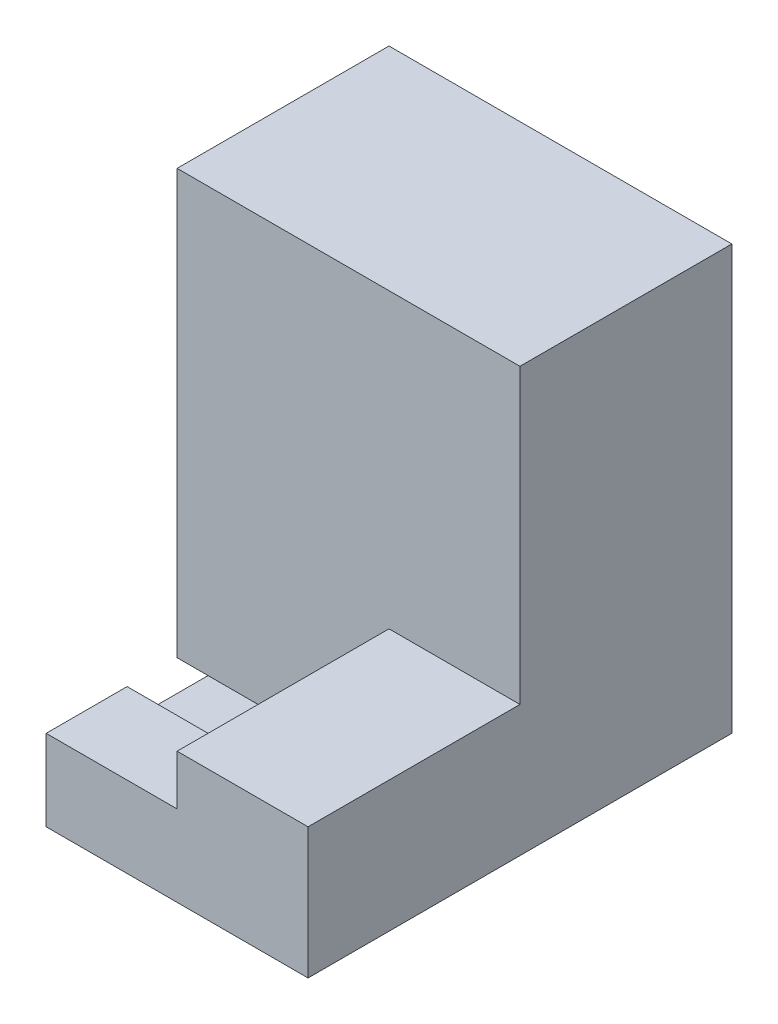
ISO-10303-21;
HEADER;
FILE_DESCRIPTION(('STEP AP214'),'2;1');
FILE_NAME('part.step','',(''),(''),'','','');
FILE_SCHEMA(('AUTOMOTIVE_DESIGN { 1 0 10303 214 1 1 1 1 }'));
ENDSEC;
DATA;
#1=APPLICATION_CONTEXT('core data for automotive mechanical design processes');
#2=APPLICATION_PROTOCOL_DEFINITION('international standard','automotive_design',2000,#1);
#3=PRODUCT_CONTEXT('',#1,'mechanical');
#4=PRODUCT('Part','Part','',(#3));
#5=PRODUCT_RELATED_PRODUCT_CATEGORY('part','',(#4));
#6=PRODUCT_DEFINITION_FORMATION('','',#4);
#7=PRODUCT_DEFINITION_CONTEXT('part definition',#1,'design');
#8=PRODUCT_DEFINITION('design','',#6,#7);
#9=PRODUCT_DEFINITION_SHAPE('','',#8);
#10=(LENGTH_UNIT() NAMED_UNIT(*) SI_UNIT(.MILLI.,.METRE.));
#11=(NAMED_UNIT(*) PLANE_ANGLE_UNIT() SI_UNIT($,.RADIAN.));
#12=(NAMED_UNIT(*) SI_UNIT($,.STERADIAN.) SOLID_ANGLE_UNIT());
#13=UNCERTAINTY_MEASURE_WITH_UNIT(LENGTH_MEASURE(1.E-05),#10,'distance_accuracy_value','');
#14=(GEOMETRIC_REPRESENTATION_CONTEXT(3) GLOBAL_UNCERTAINTY_ASSIGNED_CONTEXT((#13)) GLOBAL_UNIT_ASSIGNED_CONTEXT((#10,
#11,#12)) REPRESENTATION_CONTEXT('',''));
#15=CARTESIAN_POINT('',(0.,0.,0.));
#16=DIRECTION('',(0.,0.,1.));
#17=DIRECTION('',(1.,0.,0.));
#18=AXIS2_PLACEMENT_3D('',#15,#16,#17);
#19=CARTESIAN_POINT('',(2.00128494099436,1.,0.));
#20=DIRECTION('',(1.,0.,0.));
#21=DIRECTION('',(0.,0.,-1.));
#22=AXIS2_PLACEMENT_3D('',#19,#20,#21);
#23=PLANE('',#22);
#24=DIRECTION('',(0.,0.,1.));
#25=VECTOR('',#24,1.);
#26=CARTESIAN_POINT('',(2.00128494099436,0.,0.));
#27=LINE('',#26,#25);
#28=CARTESIAN_POINT('',(2.00128494099436,0.,-2.9976998143222));
#29=VERTEX_POINT('',#28);
#30=CARTESIAN_POINT('',(2.00128494099436,0.,0.99719090253839));
#31=VERTEX_POINT('',#30);
#32=EDGE_CURVE('E131',#29,#31,#27,.T.);
#33=ORIENTED_EDGE('',*,*,#32,.F.);
#34=DIRECTION('',(0.,-1.,0.));
#35=VECTOR('',#34,1.);
#36=CARTESIAN_POINT('',(2.00128494099436,2.,-2.9976998143222));
#37=LINE('',#36,#35);
#38=CARTESIAN_POINT('',(2.00128494099436,2.,-2.9976998143222));
#39=VERTEX_POINT('',#38);
#40=EDGE_CURVE('E181',#39,#29,#37,.T.);
#41=ORIENTED_EDGE('',*,*,#40,.F.);
#42=DIRECTION('',(0.,0.,-1.));
#43=VECTOR('',#42,1.);
#44=CARTESIAN_POINT('',(2.00128494099436,2.,0.));
#45=LINE('',#44,#43);
#46=CARTESIAN_POINT('',(2.00128494099436,2.,-1.));
#47=VERTEX_POINT('',#46);
#48=EDGE_CURVE('E198',#47,#39,#45,.T.);
#49=ORIENTED_EDGE('',*,*,#48,.F.);
#50=DIRECTION('',(0.,-1.,0.));
#51=VECTOR('',#50,1.);
#52=CARTESIAN_POINT('',(2.00128494099436,2.,-1.));
#53=LINE('',#52,#51);
#54=CARTESIAN_POINT('',(2.00128494099436,1.,-1.));
#55=VERTEX_POINT('',#54);
#56=EDGE_CURVE('E166',#47,#55,#53,.T.);
#57=ORIENTED_EDGE('',*,*,#56,.T.);
#58=DIRECTION('',(0.,0.,1.));
#59=VECTOR('',#58,1.);
#60=CARTESIAN_POINT('',(2.00128494099436,1.,0.));
#61=LINE('',#60,#59);
#62=CARTESIAN_POINT('',(2.00128494099436,1.,0.99719090253839));
#63=VERTEX_POINT('',#62);
#64=EDGE_CURVE('E108',#55,#63,#61,.T.);
#65=ORIENTED_EDGE('',*,*,#64,.T.);
#66=DIRECTION('',(0.,-1.,0.));
#67=VECTOR('',#66,1.);
#68=CARTESIAN_POINT('',(2.00128494099436,1.,0.99719090253839));
#69=LINE('',#68,#67);
#70=EDGE_CURVE('E126',#63,#31,#69,.T.);
#71=ORIENTED_EDGE('',*,*,#70,.T.);
#72=EDGE_LOOP('',(#33,#41,#49,#57,#65,#71));
#73=FACE_BOUND('',#72,.T.);
#74=ADVANCED_FACE('F65',(#73),#23,.T.);
#75=CARTESIAN_POINT('',(1.,1.,0.));
#76=DIRECTION('',(-1.,0.,0.));
#77=DIRECTION('',(0.,0.,1.));
#78=AXIS2_PLACEMENT_3D('',#75,#76,#77);
#79=PLANE('',#78);
#80=DIRECTION('',(0.,-1.,0.));
#81=VECTOR('',#80,1.);
#82=CARTESIAN_POINT('',(1.,1.,0.));
#83=LINE('',#82,#81);
#84=CARTESIAN_POINT('',(1.,1.,0.));
#85=VERTEX_POINT('',#84);
#86=CARTESIAN_POINT('',(1.,0.,0.));
#87=VERTEX_POINT('',#86);
#88=EDGE_CURVE('E12',#85,#87,#83,.T.);
#89=ORIENTED_EDGE('',*,*,#88,.F.);
#90=DIRECTION('',(0.,0.,-1.));
#91=VECTOR('',#90,1.);
#92=CARTESIAN_POINT('',(1.,1.,0.));
#93=LINE('',#92,#91);
#94=CARTESIAN_POINT('',(1.,1.,-1.));
#95=VERTEX_POINT('',#94);
#96=EDGE_CURVE('E173',#85,#95,#93,.T.);
#97=ORIENTED_EDGE('',*,*,#96,.T.);
#98=DIRECTION('',(0.,-1.,0.));
#99=VECTOR('',#98,1.);
#100=CARTESIAN_POINT('',(1.,1.,-1.));
#101=LINE('',#100,#99);
#102=CARTESIAN_POINT('',(1.,0.,-1.));
#103=VERTEX_POINT('',#102);
#104=EDGE_CURVE('E74',#95,#103,#101,.T.);
#105=ORIENTED_EDGE('',*,*,#104,.T.);
#106=DIRECTION('',(0.,0.,-1.));
#107=VECTOR('',#106,1.);
#108=CARTESIAN_POINT('',(1.,0.,0.));
#109=LINE('',#108,#107);
#110=EDGE_CURVE('E143',#87,#103,#109,.T.);
#111=ORIENTED_EDGE('',*,*,#110,.F.);
#112=EDGE_LOOP('',(#89,#97,#105,#111));
#113=FACE_BOUND('',#112,.T.);
#114=ADVANCED_FACE('F631',(#113),#79,.T.);
#115=CARTESIAN_POINT('',(0.,1.,0.99719090253839));
#116=DIRECTION('',(0.,0.,-1.));
#117=DIRECTION('',(-1.,0.,0.));
#118=AXIS2_PLACEMENT_3D('',#115,#116,#117);
#119=PLANE('',#118);
#120=DIRECTION('',(1.,0.,0.));
#121=VECTOR('',#120,1.);
#122=CARTESIAN_POINT('',(0.,0.,0.99719090253839));
#123=LINE('',#122,#121);
#124=CARTESIAN_POINT('',(0.,0.,0.99719090253839));
#125=VERTEX_POINT('',#124);
#126=EDGE_CURVE('E138',#125,#31,#123,.T.);
#127=ORIENTED_EDGE('',*,*,#126,.T.);
#128=ORIENTED_EDGE('',*,*,#70,.F.);
#129=DIRECTION('',(1.,0.,0.));
#130=VECTOR('',#129,1.);
#131=CARTESIAN_POINT('',(0.,1.,0.99719090253839));
#132=LINE('',#131,#130);
#133=CARTESIAN_POINT('',(0.,1.,0.99719090253839));
#134=VERTEX_POINT('',#133);
#135=EDGE_CURVE('E135',#134,#63,#132,.T.);
#136=ORIENTED_EDGE('',*,*,#135,.F.);
#137=DIRECTION('',(0.,-1.,0.));
#138=VECTOR('',#137,1.);
#139=CARTESIAN_POINT('',(0.,1.,0.99719090253839));
#140=LINE('',#139,#138);
#141=EDGE_CURVE('E141',#134,#125,#140,.T.);
#142=ORIENTED_EDGE('',*,*,#141,.T.);
#143=EDGE_LOOP('',(#127,#128,#136,#142));
#144=FACE_BOUND('',#143,.T.);
#145=ADVANCED_FACE('F139',(#144),#119,.F.);
#146=CARTESIAN_POINT('',(0.,1.,0.));
#147=DIRECTION('',(0.,1.,0.));
#148=DIRECTION('',(0.,0.,1.));
#149=AXIS2_PLACEMENT_3D('',#146,#147,#148);
#150=PLANE('',#149);
#151=ORIENTED_EDGE('',*,*,#64,.F.);
#152=DIRECTION('',(1.,0.,0.));
#153=VECTOR('',#152,1.);
#154=CARTESIAN_POINT('',(0.,1.,-1.));
#155=LINE('',#154,#153);
#156=EDGE_CURVE('E175',#95,#55,#155,.T.);
#157=ORIENTED_EDGE('',*,*,#156,.F.);
#158=ORIENTED_EDGE('',*,*,#96,.F.);
#159=DIRECTION('',(1.,0.,0.));
#160=VECTOR('',#159,1.);
#161=CARTESIAN_POINT('',(0.,1.,0.));
#162=LINE('',#161,#160);
#163=CARTESIAN_POINT('',(0.,1.,0.));
#164=VERTEX_POINT('',#163);
#165=EDGE_CURVE('E157',#164,#85,#162,.T.);
#166=ORIENTED_EDGE('',*,*,#165,.F.);
#167=DIRECTION('',(0.,0.,1.));
#168=VECTOR('',#167,1.);
#169=CARTESIAN_POINT('',(0.,1.,0.));
#170=LINE('',#169,#168);
#171=EDGE_CURVE('E159',#164,#134,#170,.T.);
#172=ORIENTED_EDGE('',*,*,#171,.T.);
#173=ORIENTED_EDGE('',*,*,#135,.T.);
#174=EDGE_LOOP('',(#151,#157,#158,#166,#172,#173));
#175=FACE_BOUND('',#174,.T.);
#176=ADVANCED_FACE('F174',(#175),#150,.T.);
#177=CARTESIAN_POINT('',(0.,0.,0.));
#178=DIRECTION('',(0.,1.,0.));
#179=DIRECTION('',(0.,0.,1.));
#180=AXIS2_PLACEMENT_3D('',#177,#178,#179);
#181=PLANE('',#180);
#182=ORIENTED_EDGE('',*,*,#32,.T.);
#183=ORIENTED_EDGE('',*,*,#126,.F.);
#184=DIRECTION('',(0.,0.,1.));
#185=VECTOR('',#184,1.);
#186=CARTESIAN_POINT('',(0.,0.,0.));
#187=LINE('',#186,#185);
#188=CARTESIAN_POINT('',(0.,0.,0.));
#189=VERTEX_POINT('',#188);
#190=EDGE_CURVE('E160',#189,#125,#187,.T.);
#191=ORIENTED_EDGE('',*,*,#190,.F.);
#192=DIRECTION('',(1.,0.,0.));
#193=VECTOR('',#192,1.);
#194=CARTESIAN_POINT('',(0.,0.,0.));
#195=LINE('',#194,#193);
#196=EDGE_CURVE('E163',#189,#87,#195,.T.);
#197=ORIENTED_EDGE('',*,*,#196,.T.);
#198=ORIENTED_EDGE('',*,*,#110,.T.);
#199=DIRECTION('',(1.,0.,0.));
#200=VECTOR('',#199,1.);
#201=CARTESIAN_POINT('',(0.,0.,-1.));
#202=LINE('',#201,#200);
#203=CARTESIAN_POINT('',(-1.,0.,-1.));
#204=VERTEX_POINT('',#203);
#205=EDGE_CURVE('E189',#204,#103,#202,.T.);
#206=ORIENTED_EDGE('',*,*,#205,.F.);
#207=DIRECTION('',(0.,0.,1.));
#208=VECTOR('',#207,1.);
#209=CARTESIAN_POINT('',(-1.,0.,0.));
#210=LINE('',#209,#208);
#211=CARTESIAN_POINT('',(-1.,0.,2.));
#212=VERTEX_POINT('',#211);
#213=EDGE_CURVE('E212',#204,#212,#210,.T.);
#214=ORIENTED_EDGE('',*,*,#213,.T.);
#215=DIRECTION('',(1.,0.,0.));
#216=VECTOR('',#215,1.);
#217=CARTESIAN_POINT('',(0.,0.,2.));
#218=LINE('',#217,#216);
#219=CARTESIAN_POINT('',(4.,0.,2.));
#220=VERTEX_POINT('',#219);
#221=EDGE_CURVE('E243',#212,#220,#218,.T.);
#222=ORIENTED_EDGE('',*,*,#221,.T.);
#223=DIRECTION('',(0.,0.,-1.));
#224=VECTOR('',#223,1.);
#225=CARTESIAN_POINT('',(4.,0.,0.));
#226=LINE('',#225,#224);
#227=CARTESIAN_POINT('',(4.,0.,-6.));
#228=VERTEX_POINT('',#227);
#229=EDGE_CURVE('E266',#220,#228,#226,.T.);
#230=ORIENTED_EDGE('',*,*,#229,.T.);
#231=DIRECTION('',(-1.,0.,0.));
#232=VECTOR('',#231,1.);
#233=CARTESIAN_POINT('',(0.,0.,-6.));
#234=LINE('',#233,#232);
#235=CARTESIAN_POINT('',(-9.,0.,-6.));
#236=VERTEX_POINT('',#235);
#237=EDGE_CURVE('E297',#228,#236,#234,.T.);
#238=ORIENTED_EDGE('',*,*,#237,.T.);
#239=DIRECTION('',(0.,0.,1.));
#240=VECTOR('',#239,1.);
#241=CARTESIAN_POINT('',(-9.,0.,0.));
#242=LINE('',#241,#240);
#243=CARTESIAN_POINT('',(-9.,0.,15.));
#244=VERTEX_POINT('',#243);
#245=EDGE_CURVE('E320',#236,#244,#242,.T.);
#246=ORIENTED_EDGE('',*,*,#245,.T.);
#247=DIRECTION('',(1.,0.,0.));
#248=VECTOR('',#247,1.);
#249=CARTESIAN_POINT('',(0.,0.,15.));
#250=LINE('',#249,#248);
#251=CARTESIAN_POINT('',(25.,0.,15.));
#252=VERTEX_POINT('',#251);
#253=EDGE_CURVE('E351',#244,#252,#250,.T.);
#254=ORIENTED_EDGE('',*,*,#253,.T.);
#255=DIRECTION('',(0.,0.,-1.));
#256=VECTOR('',#255,1.);
#257=CARTESIAN_POINT('',(25.,0.,0.));
#258=LINE('',#257,#256);
#259=CARTESIAN_POINT('',(25.,0.,-40.));
#260=VERTEX_POINT('',#259);
#261=EDGE_CURVE('E374',#252,#260,#258,.T.);
#262=ORIENTED_EDGE('',*,*,#261,.T.);
#263=DIRECTION('',(-1.,0.,0.));
#264=VECTOR('',#263,1.);
#265=CARTESIAN_POINT('',(0.,0.,-40.));
#266=LINE('',#265,#264);
#267=CARTESIAN_POINT('',(-64.,0.,-40.));
#268=VERTEX_POINT('',#267);
#269=EDGE_CURVE('E408',#260,#268,#266,.T.);
#270=ORIENTED_EDGE('',*,*,#269,.T.);
#271=DIRECTION('',(0.,0.,-1.));
#272=VECTOR('',#271,1.);
#273=CARTESIAN_POINT('',(-64.,0.,0.));
#274=LINE('',#273,#272);
#275=CARTESIAN_POINT('',(-64.,0.,-128.996056825207));
#276=VERTEX_POINT('',#275);
#277=EDGE_CURVE('E411',#268,#276,#274,.T.);
#278=ORIENTED_EDGE('',*,*,#277,.T.);
#279=DIRECTION('',(-1.,0.,0.));
#280=VECTOR('',#279,1.);
#281=CARTESIAN_POINT('',(0.,0.,-128.996056825207));
#282=LINE('',#281,#280);
#283=CARTESIAN_POINT('',(79.9988032331522,0.,-128.996056825207));
#284=VERTEX_POINT('',#283);
#285=EDGE_CURVE('E404',#284,#276,#282,.T.);
#286=ORIENTED_EDGE('',*,*,#285,.F.);
#287=DIRECTION('',(0.,0.,-1.));
#288=VECTOR('',#287,1.);
#289=CARTESIAN_POINT('',(79.9988032331522,0.,0.));
#290=LINE('',#289,#288);
#291=CARTESIAN_POINT('',(79.9988032331522,0.,49.0049162017066));
#292=VERTEX_POINT('',#291);
#293=EDGE_CURVE('E378',#292,#284,#290,.T.);
#294=ORIENTED_EDGE('',*,*,#293,.F.);
#295=DIRECTION('',(1.,0.,0.));
#296=VECTOR('',#295,1.);
#297=CARTESIAN_POINT('',(0.,0.,49.0049162017066));
#298=LINE('',#297,#296);
#299=CARTESIAN_POINT('',(-30.0000636841698,0.,49.0049162017066));
#300=VERTEX_POINT('',#299);
#301=EDGE_CURVE('E347',#300,#292,#298,.T.);
#302=ORIENTED_EDGE('',*,*,#301,.F.);
#303=DIRECTION('',(0.,0.,1.));
#304=VECTOR('',#303,1.);
#305=CARTESIAN_POINT('',(-30.0000636841698,0.,0.));
#306=LINE('',#305,#304);
#307=CARTESIAN_POINT('',(-30.0000636841698,0.,-18.9955752427666));
#308=VERTEX_POINT('',#307);
#309=EDGE_CURVE('E324',#308,#300,#306,.T.);
#310=ORIENTED_EDGE('',*,*,#309,.F.);
#311=DIRECTION('',(-1.,0.,0.));
#312=VECTOR('',#311,1.);
#313=CARTESIAN_POINT('',(0.,0.,-18.9955752427666));
#314=LINE('',#313,#312);
#315=CARTESIAN_POINT('',(12.0032429256272,0.,-18.9955752427666));
#316=VERTEX_POINT('',#315);
#317=EDGE_CURVE('E293',#316,#308,#314,.T.);
#318=ORIENTED_EDGE('',*,*,#317,.F.);
#319=DIRECTION('',(0.,0.,-1.));
#320=VECTOR('',#319,1.);
#321=CARTESIAN_POINT('',(12.0032429256272,0.,0.));
#322=LINE('',#321,#320);
#323=CARTESIAN_POINT('',(12.0032429256272,0.,6.99693228758156));
#324=VERTEX_POINT('',#323);
#325=EDGE_CURVE('E270',#324,#316,#322,.T.);
#326=ORIENTED_EDGE('',*,*,#325,.F.);
#327=DIRECTION('',(1.,0.,0.));
#328=VECTOR('',#327,1.);
#329=CARTESIAN_POINT('',(0.,0.,6.99693228758156));
#330=LINE('',#329,#328);
#331=CARTESIAN_POINT('',(-3.99974109811252,0.,6.99693228758156));
#332=VERTEX_POINT('',#331);
#333=EDGE_CURVE('E239',#332,#324,#330,.T.);
#334=ORIENTED_EDGE('',*,*,#333,.F.);
#335=DIRECTION('',(0.,0.,1.));
#336=VECTOR('',#335,1.);
#337=CARTESIAN_POINT('',(-3.99974109811252,0.,0.));
#338=LINE('',#337,#336);
#339=CARTESIAN_POINT('',(-3.99974109811252,0.,-2.9976998143222));
#340=VERTEX_POINT('',#339);
#341=EDGE_CURVE('E216',#340,#332,#338,.T.);
#342=ORIENTED_EDGE('',*,*,#341,.F.);
#343=DIRECTION('',(1.,0.,0.));
#344=VECTOR('',#343,1.);
#345=CARTESIAN_POINT('',(0.,0.,-2.9976998143222));
#346=LINE('',#345,#344);
#347=EDGE_CURVE('E149',#340,#29,#346,.T.);
#348=ORIENTED_EDGE('',*,*,#347,.T.);
#349=EDGE_LOOP('',(#182,#183,#191,#197,#198,#206,#214,#222,#230,#238,#246,#254,#262,#270,#278,
#286,#294,#302,#310,#318,#326,#334,#342,#348));
#350=FACE_BOUND('',#349,.T.);
#351=ADVANCED_FACE('F146',(#350),#181,.F.);
#352=CARTESIAN_POINT('',(0.,1.,0.));
#353=DIRECTION('',(1.,0.,0.));
#354=DIRECTION('',(0.,0.,-1.));
#355=AXIS2_PLACEMENT_3D('',#352,#353,#354);
#356=PLANE('',#355);
#357=ORIENTED_EDGE('',*,*,#190,.T.);
#358=ORIENTED_EDGE('',*,*,#141,.F.);
#359=ORIENTED_EDGE('',*,*,#171,.F.);
#360=DIRECTION('',(0.,-1.,0.));
#361=VECTOR('',#360,1.);
#362=CARTESIAN_POINT('',(0.,1.,0.));
#363=LINE('',#362,#361);
#364=EDGE_CURVE('E98',#164,#189,#363,.T.);
#365=ORIENTED_EDGE('',*,*,#364,.T.);
#366=EDGE_LOOP('',(#357,#358,#359,#365));
#367=FACE_BOUND('',#366,.T.);
#368=ADVANCED_FACE('F168',(#367),#356,.F.);
#369=CARTESIAN_POINT('',(0.,1.,0.));
#370=DIRECTION('',(0.,0.,-1.));
#371=DIRECTION('',(-1.,0.,0.));
#372=AXIS2_PLACEMENT_3D('',#369,#370,#371);
#373=PLANE('',#372);
#374=ORIENTED_EDGE('',*,*,#196,.F.);
#375=ORIENTED_EDGE('',*,*,#364,.F.);
#376=ORIENTED_EDGE('',*,*,#165,.T.);
#377=ORIENTED_EDGE('',*,*,#88,.T.);
#378=EDGE_LOOP('',(#374,#375,#376,#377));
#379=FACE_BOUND('',#378,.T.);
#380=ADVANCED_FACE('F67',(#379),#373,.T.);
#381=CARTESIAN_POINT('',(0.,2.,-1.));
#382=DIRECTION('',(0.,0.,-1.));
#383=DIRECTION('',(-1.,0.,0.));
#384=AXIS2_PLACEMENT_3D('',#381,#382,#383);
#385=PLANE('',#384);
#386=ORIENTED_EDGE('',*,*,#104,.F.);
#387=ORIENTED_EDGE('',*,*,#156,.T.);
#388=ORIENTED_EDGE('',*,*,#56,.F.);
#389=DIRECTION('',(1.,0.,0.));
#390=VECTOR('',#389,1.);
#391=CARTESIAN_POINT('',(0.,2.,-1.));
#392=LINE('',#391,#390);
#393=CARTESIAN_POINT('',(-1.,2.,-1.));
#394=VERTEX_POINT('',#393);
#395=EDGE_CURVE('E188',#394,#47,#392,.T.);
#396=ORIENTED_EDGE('',*,*,#395,.F.);
#397=DIRECTION('',(0.,-1.,0.));
#398=VECTOR('',#397,1.);
#399=CARTESIAN_POINT('',(-1.,2.,-1.));
#400=LINE('',#399,#398);
#401=EDGE_CURVE('E183',#394,#204,#400,.T.);
#402=ORIENTED_EDGE('',*,*,#401,.T.);
#403=ORIENTED_EDGE('',*,*,#205,.T.);
#404=EDGE_LOOP('',(#386,#387,#388,#396,#402,#403));
#405=FACE_BOUND('',#404,.T.);
#406=ADVANCED_FACE('F568',(#405),#385,.F.);
#407=CARTESIAN_POINT('',(0.,2.,-2.9976998143222));
#408=DIRECTION('',(0.,0.,-1.));
#409=DIRECTION('',(-1.,0.,0.));
#410=AXIS2_PLACEMENT_3D('',#407,#408,#409);
#411=PLANE('',#410);
#412=ORIENTED_EDGE('',*,*,#347,.F.);
#413=DIRECTION('',(0.,-1.,0.));
#414=VECTOR('',#413,1.);
#415=CARTESIAN_POINT('',(-3.99974109811252,3.,-2.9976998143222));
#416=LINE('',#415,#414);
#417=CARTESIAN_POINT('',(-3.99974109811252,3.,-2.9976998143222));
#418=VERTEX_POINT('',#417);
#419=EDGE_CURVE('E192',#418,#340,#416,.T.);
#420=ORIENTED_EDGE('',*,*,#419,.F.);
#421=DIRECTION('',(-1.,0.,0.));
#422=VECTOR('',#421,1.);
#423=CARTESIAN_POINT('',(0.,3.,-2.9976998143222));
#424=LINE('',#423,#422);
#425=CARTESIAN_POINT('',(-1.,3.,-2.9976998143222));
#426=VERTEX_POINT('',#425);
#427=EDGE_CURVE('E215',#426,#418,#424,.T.);
#428=ORIENTED_EDGE('',*,*,#427,.F.);
#429=DIRECTION('',(0.,-1.,0.));
#430=VECTOR('',#429,1.);
#431=CARTESIAN_POINT('',(-1.,3.,-2.9976998143222));
#432=LINE('',#431,#430);
#433=CARTESIAN_POINT('',(-1.,2.,-2.9976998143222));
#434=VERTEX_POINT('',#433);
#435=EDGE_CURVE('E208',#426,#434,#432,.T.);
#436=ORIENTED_EDGE('',*,*,#435,.T.);
#437=DIRECTION('',(1.,0.,0.));
#438=VECTOR('',#437,1.);
#439=CARTESIAN_POINT('',(0.,2.,-2.9976998143222));
#440=LINE('',#439,#438);
#441=EDGE_CURVE('E195',#434,#39,#440,.T.);
#442=ORIENTED_EDGE('',*,*,#441,.T.);
#443=ORIENTED_EDGE('',*,*,#40,.T.);
#444=EDGE_LOOP('',(#412,#420,#428,#436,#442,#443));
#445=FACE_BOUND('',#444,.T.);
#446=ADVANCED_FACE('F623',(#445),#411,.T.);
#447=CARTESIAN_POINT('',(0.,2.,0.));
#448=DIRECTION('',(0.,1.,0.));
#449=DIRECTION('',(0.,0.,1.));
#450=AXIS2_PLACEMENT_3D('',#447,#448,#449);
#451=PLANE('',#450);
#452=ORIENTED_EDGE('',*,*,#395,.T.);
#453=ORIENTED_EDGE('',*,*,#48,.T.);
#454=ORIENTED_EDGE('',*,*,#441,.F.);
#455=DIRECTION('',(0.,0.,-1.));
#456=VECTOR('',#455,1.);
#457=CARTESIAN_POINT('',(-1.,2.,0.));
#458=LINE('',#457,#456);
#459=EDGE_CURVE('E186',#394,#434,#458,.T.);
#460=ORIENTED_EDGE('',*,*,#459,.F.);
#461=EDGE_LOOP('',(#452,#453,#454,#460));
#462=FACE_BOUND('',#461,.T.);
#463=ADVANCED_FACE('F642',(#462),#451,.T.);
#464=CARTESIAN_POINT('',(-1.,3.,0.));
#465=DIRECTION('',(1.,0.,0.));
#466=DIRECTION('',(0.,0.,-1.));
#467=AXIS2_PLACEMENT_3D('',#464,#465,#466);
#468=PLANE('',#467);
#469=ORIENTED_EDGE('',*,*,#401,.F.);
#470=ORIENTED_EDGE('',*,*,#459,.T.);
#471=ORIENTED_EDGE('',*,*,#435,.F.);
#472=DIRECTION('',(0.,0.,1.));
#473=VECTOR('',#472,1.);
#474=CARTESIAN_POINT('',(-1.,3.,0.));
#475=LINE('',#474,#473);
#476=CARTESIAN_POINT('',(-1.,3.,2.));
#477=VERTEX_POINT('',#476);
#478=EDGE_CURVE('E211',#426,#477,#475,.T.);
#479=ORIENTED_EDGE('',*,*,#478,.T.);
#480=DIRECTION('',(0.,-1.,0.));
#481=VECTOR('',#480,1.);
#482=CARTESIAN_POINT('',(-1.,3.,2.));
#483=LINE('',#482,#481);
#484=EDGE_CURVE('E205',#477,#212,#483,.T.);
#485=ORIENTED_EDGE('',*,*,#484,.T.);
#486=ORIENTED_EDGE('',*,*,#213,.F.);
#487=EDGE_LOOP('',(#469,#470,#471,#479,#485,#486));
#488=FACE_BOUND('',#487,.T.);
#489=ADVANCED_FACE('F573',(#488),#468,.T.);
#490=CARTESIAN_POINT('',(-3.99974109811252,3.,0.));
#491=DIRECTION('',(1.,0.,0.));
#492=DIRECTION('',(0.,0.,-1.));
#493=AXIS2_PLACEMENT_3D('',#490,#491,#492);
#494=PLANE('',#493);
#495=ORIENTED_EDGE('',*,*,#341,.T.);
#496=DIRECTION('',(0.,-1.,0.));
#497=VECTOR('',#496,1.);
#498=CARTESIAN_POINT('',(-3.99974109811252,5.,6.99693228758156));
#499=LINE('',#498,#497);
#500=CARTESIAN_POINT('',(-3.99974109811252,5.,6.99693228758156));
#501=VERTEX_POINT('',#500);
#502=EDGE_CURVE('E235',#501,#332,#499,.T.);
#503=ORIENTED_EDGE('',*,*,#502,.F.);
#504=DIRECTION('',(0.,0.,1.));
#505=VECTOR('',#504,1.);
#506=CARTESIAN_POINT('',(-3.99974109811252,5.,0.));
#507=LINE('',#506,#505);
#508=CARTESIAN_POINT('',(-3.99974109811252,5.,2.));
#509=VERTEX_POINT('',#508);
#510=EDGE_CURVE('E249',#509,#501,#507,.T.);
#511=ORIENTED_EDGE('',*,*,#510,.F.);
#512=DIRECTION('',(0.,-1.,0.));
#513=VECTOR('',#512,1.);
#514=CARTESIAN_POINT('',(-3.99974109811252,5.,2.));
#515=LINE('',#514,#513);
#516=CARTESIAN_POINT('',(-3.99974109811252,3.,2.));
#517=VERTEX_POINT('',#516);
#518=EDGE_CURVE('E232',#509,#517,#515,.T.);
#519=ORIENTED_EDGE('',*,*,#518,.T.);
#520=DIRECTION('',(0.,0.,1.));
#521=VECTOR('',#520,1.);
#522=CARTESIAN_POINT('',(-3.99974109811252,3.,0.));
#523=LINE('',#522,#521);
#524=EDGE_CURVE('E225',#418,#517,#523,.T.);
#525=ORIENTED_EDGE('',*,*,#524,.F.);
#526=ORIENTED_EDGE('',*,*,#419,.T.);
#527=EDGE_LOOP('',(#495,#503,#511,#519,#525,#526));
#528=FACE_BOUND('',#527,.T.);
#529=ADVANCED_FACE('F647',(#528),#494,.F.);
#530=CARTESIAN_POINT('',(0.,3.,0.));
#531=DIRECTION('',(0.,1.,0.));
#532=DIRECTION('',(0.,0.,1.));
#533=AXIS2_PLACEMENT_3D('',#530,#531,#532);
#534=PLANE('',#533);
#535=ORIENTED_EDGE('',*,*,#427,.T.);
#536=ORIENTED_EDGE('',*,*,#524,.T.);
#537=DIRECTION('',(-1.,0.,0.));
#538=VECTOR('',#537,1.);
#539=CARTESIAN_POINT('',(0.,3.,2.));
#540=LINE('',#539,#538);
#541=EDGE_CURVE('E222',#477,#517,#540,.T.);
#542=ORIENTED_EDGE('',*,*,#541,.F.);
#543=ORIENTED_EDGE('',*,*,#478,.F.);
#544=EDGE_LOOP('',(#535,#536,#542,#543));
#545=FACE_BOUND('',#544,.T.);
#546=ADVANCED_FACE('F650',(#545),#534,.T.);
#547=CARTESIAN_POINT('',(0.,5.,2.));
#548=DIRECTION('',(0.,0.,-1.));
#549=DIRECTION('',(-1.,0.,0.));
#550=AXIS2_PLACEMENT_3D('',#547,#548,#549);
#551=PLANE('',#550);
#552=ORIENTED_EDGE('',*,*,#484,.F.);
#553=ORIENTED_EDGE('',*,*,#541,.T.);
#554=ORIENTED_EDGE('',*,*,#518,.F.);
#555=DIRECTION('',(1.,0.,0.));
#556=VECTOR('',#555,1.);
#557=CARTESIAN_POINT('',(0.,5.,2.));
#558=LINE('',#557,#556);
#559=CARTESIAN_POINT('',(4.,5.,2.));
#560=VERTEX_POINT('',#559);
#561=EDGE_CURVE('E252',#509,#560,#558,.T.);
#562=ORIENTED_EDGE('',*,*,#561,.T.);
#563=DIRECTION('',(0.,-1.,0.));
#564=VECTOR('',#563,1.);
#565=CARTESIAN_POINT('',(4.,5.,2.));
#566=LINE('',#565,#564);
#567=EDGE_CURVE('E219',#560,#220,#566,.T.);
#568=ORIENTED_EDGE('',*,*,#567,.T.);
#569=ORIENTED_EDGE('',*,*,#221,.F.);
#570=EDGE_LOOP('',(#552,#553,#554,#562,#568,#569));
#571=FACE_BOUND('',#570,.T.);
#572=ADVANCED_FACE('F578',(#571),#551,.T.);
#573=CARTESIAN_POINT('',(0.,5.,6.99693228758156));
#574=DIRECTION('',(0.,0.,-1.));
#575=DIRECTION('',(-1.,0.,0.));
#576=AXIS2_PLACEMENT_3D('',#573,#574,#575);
#577=PLANE('',#576);
#578=ORIENTED_EDGE('',*,*,#333,.T.);
#579=DIRECTION('',(0.,-1.,0.));
#580=VECTOR('',#579,1.);
#581=CARTESIAN_POINT('',(12.0032429256272,8.,6.99693228758156));
#582=LINE('',#581,#580);
#583=CARTESIAN_POINT('',(12.0032429256272,8.,6.99693228758156));
#584=VERTEX_POINT('',#583);
#585=EDGE_CURVE('E246',#584,#324,#582,.T.);
#586=ORIENTED_EDGE('',*,*,#585,.F.);
#587=DIRECTION('',(1.,0.,0.));
#588=VECTOR('',#587,1.);
#589=CARTESIAN_POINT('',(0.,8.,6.99693228758156));
#590=LINE('',#589,#588);
#591=CARTESIAN_POINT('',(4.,8.,6.99693228758156));
#592=VERTEX_POINT('',#591);
#593=EDGE_CURVE('E269',#592,#584,#590,.T.);
#594=ORIENTED_EDGE('',*,*,#593,.F.);
#595=DIRECTION('',(0.,-1.,0.));
#596=VECTOR('',#595,1.);
#597=CARTESIAN_POINT('',(4.,8.,6.99693228758156));
#598=LINE('',#597,#596);
#599=CARTESIAN_POINT('',(4.,5.,6.99693228758156));
#600=VERTEX_POINT('',#599);
#601=EDGE_CURVE('E262',#592,#600,#598,.T.);
#602=ORIENTED_EDGE('',*,*,#601,.T.);
#603=DIRECTION('',(1.,0.,0.));
#604=VECTOR('',#603,1.);
#605=CARTESIAN_POINT('',(0.,5.,6.99693228758156));
#606=LINE('',#605,#604);
#607=EDGE_CURVE('E238',#501,#600,#606,.T.);
#608=ORIENTED_EDGE('',*,*,#607,.F.);
#609=ORIENTED_EDGE('',*,*,#502,.T.);
#610=EDGE_LOOP('',(#578,#586,#594,#602,#608,#609));
#611=FACE_BOUND('',#610,.T.);
#612=ADVANCED_FACE('F659',(#611),#577,.F.);
#613=CARTESIAN_POINT('',(0.,5.,0.));
#614=DIRECTION('',(0.,1.,0.));
#615=DIRECTION('',(0.,0.,1.));
#616=AXIS2_PLACEMENT_3D('',#613,#614,#615);
#617=PLANE('',#616);
#618=DIRECTION('',(0.,0.,1.));
#619=VECTOR('',#618,1.);
#620=CARTESIAN_POINT('',(4.,5.,0.));
#621=LINE('',#620,#619);
#622=EDGE_CURVE('E242',#560,#600,#621,.T.);
#623=ORIENTED_EDGE('',*,*,#622,.F.);
#624=ORIENTED_EDGE('',*,*,#561,.F.);
#625=ORIENTED_EDGE('',*,*,#510,.T.);
#626=ORIENTED_EDGE('',*,*,#607,.T.);
#627=EDGE_LOOP('',(#623,#624,#625,#626));
#628=FACE_BOUND('',#627,.T.);
#629=ADVANCED_FACE('F662',(#628),#617,.T.);
#630=CARTESIAN_POINT('',(4.,8.,0.));
#631=DIRECTION('',(-1.,0.,0.));
#632=DIRECTION('',(0.,0.,1.));
#633=AXIS2_PLACEMENT_3D('',#630,#631,#632);
#634=PLANE('',#633);
#635=ORIENTED_EDGE('',*,*,#567,.F.);
#636=ORIENTED_EDGE('',*,*,#622,.T.);
#637=ORIENTED_EDGE('',*,*,#601,.F.);
#638=DIRECTION('',(0.,0.,-1.));
#639=VECTOR('',#638,1.);
#640=CARTESIAN_POINT('',(4.,8.,0.));
#641=LINE('',#640,#639);
#642=CARTESIAN_POINT('',(4.,8.,-6.));
#643=VERTEX_POINT('',#642);
#644=EDGE_CURVE('E265',#592,#643,#641,.T.);
#645=ORIENTED_EDGE('',*,*,#644,.T.);
#646=DIRECTION('',(0.,-1.,0.));
#647=VECTOR('',#646,1.);
#648=CARTESIAN_POINT('',(4.,8.,-6.));
#649=LINE('',#648,#647);
#650=EDGE_CURVE('E259',#643,#228,#649,.T.);
#651=ORIENTED_EDGE('',*,*,#650,.T.);
#652=ORIENTED_EDGE('',*,*,#229,.F.);
#653=EDGE_LOOP('',(#635,#636,#637,#645,#651,#652));
#654=FACE_BOUND('',#653,.T.);
#655=ADVANCED_FACE('F584',(#654),#634,.T.);
#656=CARTESIAN_POINT('',(12.0032429256272,8.,0.));
#657=DIRECTION('',(-1.,0.,0.));
#658=DIRECTION('',(0.,0.,1.));
#659=AXIS2_PLACEMENT_3D('',#656,#657,#658);
#660=PLANE('',#659);
#661=ORIENTED_EDGE('',*,*,#325,.T.);
#662=DIRECTION('',(0.,-1.,0.));
#663=VECTOR('',#662,1.);
#664=CARTESIAN_POINT('',(12.0032429256272,13.,-18.9955752427666));
#665=LINE('',#664,#663);
#666=CARTESIAN_POINT('',(12.0032429256272,13.,-18.9955752427666));
#667=VERTEX_POINT('',#666);
#668=EDGE_CURVE('E289',#667,#316,#665,.T.);
#669=ORIENTED_EDGE('',*,*,#668,.F.);
#670=DIRECTION('',(0.,0.,-1.));
#671=VECTOR('',#670,1.);
#672=CARTESIAN_POINT('',(12.0032429256272,13.,0.));
#673=LINE('',#672,#671);
#674=CARTESIAN_POINT('',(12.0032429256272,13.,-6.));
#675=VERTEX_POINT('',#674);
#676=EDGE_CURVE('E303',#675,#667,#673,.T.);
#677=ORIENTED_EDGE('',*,*,#676,.F.);
#678=DIRECTION('',(0.,-1.,0.));
#679=VECTOR('',#678,1.);
#680=CARTESIAN_POINT('',(12.0032429256272,13.,-6.));
#681=LINE('',#680,#679);
#682=CARTESIAN_POINT('',(12.0032429256272,8.,-6.));
#683=VERTEX_POINT('',#682);
#684=EDGE_CURVE('E286',#675,#683,#681,.T.);
#685=ORIENTED_EDGE('',*,*,#684,.T.);
#686=DIRECTION('',(0.,0.,-1.));
#687=VECTOR('',#686,1.);
#688=CARTESIAN_POINT('',(12.0032429256272,8.,0.));
#689=LINE('',#688,#687);
#690=EDGE_CURVE('E279',#584,#683,#689,.T.);
#691=ORIENTED_EDGE('',*,*,#690,.F.);
#692=ORIENTED_EDGE('',*,*,#585,.T.);
#693=EDGE_LOOP('',(#661,#669,#677,#685,#691,#692));
#694=FACE_BOUND('',#693,.T.);
#695=ADVANCED_FACE('F667',(#694),#660,.F.);
#696=CARTESIAN_POINT('',(0.,8.,0.));
#697=DIRECTION('',(0.,1.,0.));
#698=DIRECTION('',(0.,0.,1.));
#699=AXIS2_PLACEMENT_3D('',#696,#697,#698);
#700=PLANE('',#699);
#701=ORIENTED_EDGE('',*,*,#593,.T.);
#702=ORIENTED_EDGE('',*,*,#690,.T.);
#703=DIRECTION('',(1.,0.,0.));
#704=VECTOR('',#703,1.);
#705=CARTESIAN_POINT('',(0.,8.,-6.));
#706=LINE('',#705,#704);
#707=EDGE_CURVE('E276',#643,#683,#706,.T.);
#708=ORIENTED_EDGE('',*,*,#707,.F.);
#709=ORIENTED_EDGE('',*,*,#644,.F.);
#710=EDGE_LOOP('',(#701,#702,#708,#709));
#711=FACE_BOUND('',#710,.T.);
#712=ADVANCED_FACE('F670',(#711),#700,.T.);
#713=CARTESIAN_POINT('',(0.,13.,-6.));
#714=DIRECTION('',(0.,0.,1.));
#715=DIRECTION('',(1.,0.,0.));
#716=AXIS2_PLACEMENT_3D('',#713,#714,#715);
#717=PLANE('',#716);
#718=ORIENTED_EDGE('',*,*,#650,.F.);
#719=ORIENTED_EDGE('',*,*,#707,.T.);
#720=ORIENTED_EDGE('',*,*,#684,.F.);
#721=DIRECTION('',(-1.,0.,0.));
#722=VECTOR('',#721,1.);
#723=CARTESIAN_POINT('',(0.,13.,-6.));
#724=LINE('',#723,#722);
#725=CARTESIAN_POINT('',(-9.,13.,-6.));
#726=VERTEX_POINT('',#725);
#727=EDGE_CURVE('E306',#675,#726,#724,.T.);
#728=ORIENTED_EDGE('',*,*,#727,.T.);
#729=DIRECTION('',(0.,-1.,0.));
#730=VECTOR('',#729,1.);
#731=CARTESIAN_POINT('',(-9.,13.,-6.));
#732=LINE('',#731,#730);
#733=EDGE_CURVE('E273',#726,#236,#732,.T.);
#734=ORIENTED_EDGE('',*,*,#733,.T.);
#735=ORIENTED_EDGE('',*,*,#237,.F.);
#736=EDGE_LOOP('',(#718,#719,#720,#728,#734,#735));
#737=FACE_BOUND('',#736,.T.);
#738=ADVANCED_FACE('F587',(#737),#717,.T.);
#739=CARTESIAN_POINT('',(0.,13.,-18.9955752427666));
#740=DIRECTION('',(0.,0.,1.));
#741=DIRECTION('',(1.,0.,0.));
#742=AXIS2_PLACEMENT_3D('',#739,#740,#741);
#743=PLANE('',#742);
#744=ORIENTED_EDGE('',*,*,#317,.T.);
#745=DIRECTION('',(0.,-1.,0.));
#746=VECTOR('',#745,1.);
#747=CARTESIAN_POINT('',(-30.0000636841698,21.,-18.9955752427666));
#748=LINE('',#747,#746);
#749=CARTESIAN_POINT('',(-30.0000636841698,21.,-18.9955752427666));
#750=VERTEX_POINT('',#749);
#751=EDGE_CURVE('E300',#750,#308,#748,.T.);
#752=ORIENTED_EDGE('',*,*,#751,.F.);
#753=DIRECTION('',(-1.,0.,0.));
#754=VECTOR('',#753,1.);
#755=CARTESIAN_POINT('',(0.,21.,-18.9955752427666));
#756=LINE('',#755,#754);
#757=CARTESIAN_POINT('',(-9.,21.,-18.9955752427666));
#758=VERTEX_POINT('',#757);
#759=EDGE_CURVE('E323',#758,#750,#756,.T.);
#760=ORIENTED_EDGE('',*,*,#759,.F.);
#761=DIRECTION('',(0.,-1.,0.));
#762=VECTOR('',#761,1.);
#763=CARTESIAN_POINT('',(-9.,21.,-18.9955752427666));
#764=LINE('',#763,#762);
#765=CARTESIAN_POINT('',(-9.,13.,-18.9955752427666));
#766=VERTEX_POINT('',#765);
#767=EDGE_CURVE('E316',#758,#766,#764,.T.);
#768=ORIENTED_EDGE('',*,*,#767,.T.);
#769=DIRECTION('',(-1.,0.,0.));
#770=VECTOR('',#769,1.);
#771=CARTESIAN_POINT('',(0.,13.,-18.9955752427666));
#772=LINE('',#771,#770);
#773=EDGE_CURVE('E292',#667,#766,#772,.T.);
#774=ORIENTED_EDGE('',*,*,#773,.F.);
#775=ORIENTED_EDGE('',*,*,#668,.T.);
#776=EDGE_LOOP('',(#744,#752,#760,#768,#774,#775));
#777=FACE_BOUND('',#776,.T.);
#778=ADVANCED_FACE('F679',(#777),#743,.F.);
#779=CARTESIAN_POINT('',(0.,13.,0.));
#780=DIRECTION('',(0.,1.,0.));
#781=DIRECTION('',(0.,0.,1.));
#782=AXIS2_PLACEMENT_3D('',#779,#780,#781);
#783=PLANE('',#782);
#784=DIRECTION('',(0.,0.,-1.));
#785=VECTOR('',#784,1.);
#786=CARTESIAN_POINT('',(-9.,13.,0.));
#787=LINE('',#786,#785);
#788=EDGE_CURVE('E296',#726,#766,#787,.T.);
#789=ORIENTED_EDGE('',*,*,#788,.F.);
#790=ORIENTED_EDGE('',*,*,#727,.F.);
#791=ORIENTED_EDGE('',*,*,#676,.T.);
#792=ORIENTED_EDGE('',*,*,#773,.T.);
#793=EDGE_LOOP('',(#789,#790,#791,#792));
#794=FACE_BOUND('',#793,.T.);
#795=ADVANCED_FACE('F682',(#794),#783,.T.);
#796=CARTESIAN_POINT('',(-9.,21.,0.));
#797=DIRECTION('',(1.,0.,0.));
#798=DIRECTION('',(0.,0.,-1.));
#799=AXIS2_PLACEMENT_3D('',#796,#797,#798);
#800=PLANE('',#799);
#801=ORIENTED_EDGE('',*,*,#733,.F.);
#802=ORIENTED_EDGE('',*,*,#788,.T.);
#803=ORIENTED_EDGE('',*,*,#767,.F.);
#804=DIRECTION('',(0.,0.,1.));
#805=VECTOR('',#804,1.);
#806=CARTESIAN_POINT('',(-9.,21.,0.));
#807=LINE('',#806,#805);
#808=CARTESIAN_POINT('',(-9.,21.,15.));
#809=VERTEX_POINT('',#808);
#810=EDGE_CURVE('E319',#758,#809,#807,.T.);
#811=ORIENTED_EDGE('',*,*,#810,.T.);
#812=DIRECTION('',(0.,-1.,0.));
#813=VECTOR('',#812,1.);
#814=CARTESIAN_POINT('',(-9.,21.,15.));
#815=LINE('',#814,#813);
#816=EDGE_CURVE('E313',#809,#244,#815,.T.);
#817=ORIENTED_EDGE('',*,*,#816,.T.);
#818=ORIENTED_EDGE('',*,*,#245,.F.);
#819=EDGE_LOOP('',(#801,#802,#803,#811,#817,#818));
#820=FACE_BOUND('',#819,.T.);
#821=ADVANCED_FACE('F592',(#820),#800,.T.);
#822=CARTESIAN_POINT('',(-30.0000636841698,21.,0.));
#823=DIRECTION('',(1.,0.,0.));
#824=DIRECTION('',(0.,0.,-1.));
#825=AXIS2_PLACEMENT_3D('',#822,#823,#824);
#826=PLANE('',#825);
#827=ORIENTED_EDGE('',*,*,#309,.T.);
#828=DIRECTION('',(0.,-1.,0.));
#829=VECTOR('',#828,1.);
#830=CARTESIAN_POINT('',(-30.0000636841698,34.,49.0049162017066));
#831=LINE('',#830,#829);
#832=CARTESIAN_POINT('',(-30.0000636841698,34.,49.0049162017066));
#833=VERTEX_POINT('',#832);
#834=EDGE_CURVE('E343',#833,#300,#831,.T.);
#835=ORIENTED_EDGE('',*,*,#834,.F.);
#836=DIRECTION('',(0.,0.,1.));
#837=VECTOR('',#836,1.);
#838=CARTESIAN_POINT('',(-30.0000636841698,34.,0.));
#839=LINE('',#838,#837);
#840=CARTESIAN_POINT('',(-30.0000636841698,34.,15.));
#841=VERTEX_POINT('',#840);
#842=EDGE_CURVE('E357',#841,#833,#839,.T.);
#843=ORIENTED_EDGE('',*,*,#842,.F.);
#844=DIRECTION('',(0.,-1.,0.));
#845=VECTOR('',#844,1.);
#846=CARTESIAN_POINT('',(-30.0000636841698,34.,15.));
#847=LINE('',#846,#845);
#848=CARTESIAN_POINT('',(-30.0000636841698,21.,15.));
#849=VERTEX_POINT('',#848);
#850=EDGE_CURVE('E340',#841,#849,#847,.T.);
#851=ORIENTED_EDGE('',*,*,#850,.T.);
#852=DIRECTION('',(0.,0.,1.));
#853=VECTOR('',#852,1.);
#854=CARTESIAN_POINT('',(-30.0000636841698,21.,0.));
#855=LINE('',#854,#853);
#856=EDGE_CURVE('E333',#750,#849,#855,.T.);
#857=ORIENTED_EDGE('',*,*,#856,.F.);
#858=ORIENTED_EDGE('',*,*,#751,.T.);
#859=EDGE_LOOP('',(#827,#835,#843,#851,#857,#858));
#860=FACE_BOUND('',#859,.T.);
#861=ADVANCED_FACE('F687',(#860),#826,.F.);
#862=CARTESIAN_POINT('',(0.,21.,0.));
#863=DIRECTION('',(0.,1.,0.));
#864=DIRECTION('',(0.,0.,1.));
#865=AXIS2_PLACEMENT_3D('',#862,#863,#864);
#866=PLANE('',#865);
#867=ORIENTED_EDGE('',*,*,#759,.T.);
#868=ORIENTED_EDGE('',*,*,#856,.T.);
#869=DIRECTION('',(-1.,0.,0.));
#870=VECTOR('',#869,1.);
#871=CARTESIAN_POINT('',(0.,21.,15.));
#872=LINE('',#871,#870);
#873=EDGE_CURVE('E330',#809,#849,#872,.T.);
#874=ORIENTED_EDGE('',*,*,#873,.F.);
#875=ORIENTED_EDGE('',*,*,#810,.F.);
#876=EDGE_LOOP('',(#867,#868,#874,#875));
#877=FACE_BOUND('',#876,.T.);
#878=ADVANCED_FACE('F690',(#877),#866,.T.);
#879=CARTESIAN_POINT('',(0.,34.,15.));
#880=DIRECTION('',(0.,0.,-1.));
#881=DIRECTION('',(-1.,0.,0.));
#882=AXIS2_PLACEMENT_3D('',#879,#880,#881);
#883=PLANE('',#882);
#884=ORIENTED_EDGE('',*,*,#816,.F.);
#885=ORIENTED_EDGE('',*,*,#873,.T.);
#886=ORIENTED_EDGE('',*,*,#850,.F.);
#887=DIRECTION('',(1.,0.,0.));
#888=VECTOR('',#887,1.);
#889=CARTESIAN_POINT('',(0.,34.,15.));
#890=LINE('',#889,#888);
#891=CARTESIAN_POINT('',(25.,34.,15.));
#892=VERTEX_POINT('',#891);
#893=EDGE_CURVE('E360',#841,#892,#890,.T.);
#894=ORIENTED_EDGE('',*,*,#893,.T.);
#895=DIRECTION('',(0.,-1.,0.));
#896=VECTOR('',#895,1.);
#897=CARTESIAN_POINT('',(25.,34.,15.));
#898=LINE('',#897,#896);
#899=EDGE_CURVE('E327',#892,#252,#898,.T.);
#900=ORIENTED_EDGE('',*,*,#899,.T.);
#901=ORIENTED_EDGE('',*,*,#253,.F.);
#902=EDGE_LOOP('',(#884,#885,#886,#894,#900,#901));
#903=FACE_BOUND('',#902,.T.);
#904=ADVANCED_FACE('F598',(#903),#883,.T.);
#905=CARTESIAN_POINT('',(0.,34.,49.0049162017066));
#906=DIRECTION('',(0.,0.,-1.));
#907=DIRECTION('',(-1.,0.,0.));
#908=AXIS2_PLACEMENT_3D('',#905,#906,#907);
#909=PLANE('',#908);
#910=ORIENTED_EDGE('',*,*,#301,.T.);
#911=DIRECTION('',(0.,-1.,0.));
#912=VECTOR('',#911,1.);
#913=CARTESIAN_POINT('',(79.9988032331522,55.,49.0049162017066));
#914=LINE('',#913,#912);
#915=CARTESIAN_POINT('',(79.9988032331522,55.,49.0049162017066));
#916=VERTEX_POINT('',#915);
#917=EDGE_CURVE('E354',#916,#292,#914,.T.);
#918=ORIENTED_EDGE('',*,*,#917,.F.);
#919=DIRECTION('',(1.,0.,0.));
#920=VECTOR('',#919,1.);
#921=CARTESIAN_POINT('',(0.,55.,49.0049162017066));
#922=LINE('',#921,#920);
#923=CARTESIAN_POINT('',(25.,55.,49.0049162017066));
#924=VERTEX_POINT('',#923);
#925=EDGE_CURVE('E377',#924,#916,#922,.T.);
#926=ORIENTED_EDGE('',*,*,#925,.F.);
#927=DIRECTION('',(0.,-1.,0.));
#928=VECTOR('',#927,1.);
#929=CARTESIAN_POINT('',(25.,55.,49.0049162017066));
#930=LINE('',#929,#928);
#931=CARTESIAN_POINT('',(25.,34.,49.0049162017066));
#932=VERTEX_POINT('',#931);
#933=EDGE_CURVE('E370',#924,#932,#930,.T.);
#934=ORIENTED_EDGE('',*,*,#933,.T.);
#935=DIRECTION('',(1.,0.,0.));
#936=VECTOR('',#935,1.);
#937=CARTESIAN_POINT('',(0.,34.,49.0049162017066));
#938=LINE('',#937,#936);
#939=EDGE_CURVE('E346',#833,#932,#938,.T.);
#940=ORIENTED_EDGE('',*,*,#939,.F.);
#941=ORIENTED_EDGE('',*,*,#834,.T.);
#942=EDGE_LOOP('',(#910,#918,#926,#934,#940,#941));
#943=FACE_BOUND('',#942,.T.);
#944=ADVANCED_FACE('F699',(#943),#909,.F.);
#945=CARTESIAN_POINT('',(0.,34.,0.));
#946=DIRECTION('',(0.,1.,0.));
#947=DIRECTION('',(0.,0.,1.));
#948=AXIS2_PLACEMENT_3D('',#945,#946,#947);
#949=PLANE('',#948);
#950=DIRECTION('',(0.,0.,1.));
#951=VECTOR('',#950,1.);
#952=CARTESIAN_POINT('',(25.,34.,0.));
#953=LINE('',#952,#951);
#954=EDGE_CURVE('E350',#892,#932,#953,.T.);
#955=ORIENTED_EDGE('',*,*,#954,.F.);
#956=ORIENTED_EDGE('',*,*,#893,.F.);
#957=ORIENTED_EDGE('',*,*,#842,.T.);
#958=ORIENTED_EDGE('',*,*,#939,.T.);
#959=EDGE_LOOP('',(#955,#956,#957,#958));
#960=FACE_BOUND('',#959,.T.);
#961=ADVANCED_FACE('F702',(#960),#949,.T.);
#962=CARTESIAN_POINT('',(25.,55.,0.));
#963=DIRECTION('',(-1.,0.,0.));
#964=DIRECTION('',(0.,0.,1.));
#965=AXIS2_PLACEMENT_3D('',#962,#963,#964);
#966=PLANE('',#965);
#967=ORIENTED_EDGE('',*,*,#899,.F.);
#968=ORIENTED_EDGE('',*,*,#954,.T.);
#969=ORIENTED_EDGE('',*,*,#933,.F.);
#970=DIRECTION('',(0.,0.,-1.));
#971=VECTOR('',#970,1.);
#972=CARTESIAN_POINT('',(25.,55.,0.));
#973=LINE('',#972,#971);
#974=CARTESIAN_POINT('',(25.,55.,-40.));
#975=VERTEX_POINT('',#974);
#976=EDGE_CURVE('E373',#924,#975,#973,.T.);
#977=ORIENTED_EDGE('',*,*,#976,.T.);
#978=DIRECTION('',(0.,-1.,0.));
#979=VECTOR('',#978,1.);
#980=CARTESIAN_POINT('',(25.,55.,-40.));
#981=LINE('',#980,#979);
#982=EDGE_CURVE('E367',#975,#260,#981,.T.);
#983=ORIENTED_EDGE('',*,*,#982,.T.);
#984=ORIENTED_EDGE('',*,*,#261,.F.);
#985=EDGE_LOOP('',(#967,#968,#969,#977,#983,#984));
#986=FACE_BOUND('',#985,.T.);
#987=ADVANCED_FACE('F601',(#986),#966,.T.);
#988=CARTESIAN_POINT('',(79.9988032331522,55.,0.));
#989=DIRECTION('',(-1.,0.,0.));
#990=DIRECTION('',(0.,0.,1.));
#991=AXIS2_PLACEMENT_3D('',#988,#989,#990);
#992=PLANE('',#991);
#993=ORIENTED_EDGE('',*,*,#293,.T.);
#994=DIRECTION('',(0.,-1.,0.));
#995=VECTOR('',#994,1.);
#996=CARTESIAN_POINT('',(79.9988032331522,178.,-128.996056825207));
#997=LINE('',#996,#995);
#998=CARTESIAN_POINT('',(79.9988032331522,178.,-128.996056825207));
#999=VERTEX_POINT('',#998);
#1000=EDGE_CURVE('E397',#999,#284,#997,.T.);
#1001=ORIENTED_EDGE('',*,*,#1000,.F.);
#1002=DIRECTION('',(0.,0.,-1.));
#1003=VECTOR('',#1002,1.);
#1004=CARTESIAN_POINT('',(79.9988032331522,178.,0.));
#1005=LINE('',#1004,#1003);
#1006=CARTESIAN_POINT('',(79.9988032331522,178.,-40.));
#1007=VERTEX_POINT('',#1006);
#1008=EDGE_CURVE('E416',#1007,#999,#1005,.T.);
#1009=ORIENTED_EDGE('',*,*,#1008,.F.);
#1010=DIRECTION('',(0.,-1.,0.));
#1011=VECTOR('',#1010,1.);
#1012=CARTESIAN_POINT('',(79.9988032331522,178.,-40.));
#1013=LINE('',#1012,#1011);
#1014=CARTESIAN_POINT('',(79.9988032331522,55.,-40.));
#1015=VERTEX_POINT('',#1014);
#1016=EDGE_CURVE('E394',#1007,#1015,#1013,.T.);
#1017=ORIENTED_EDGE('',*,*,#1016,.T.);
#1018=DIRECTION('',(0.,0.,-1.));
#1019=VECTOR('',#1018,1.);
#1020=CARTESIAN_POINT('',(79.9988032331522,55.,0.));
#1021=LINE('',#1020,#1019);
#1022=EDGE_CURVE('E387',#916,#1015,#1021,.T.);
#1023=ORIENTED_EDGE('',*,*,#1022,.F.);
#1024=ORIENTED_EDGE('',*,*,#917,.T.);
#1025=EDGE_LOOP('',(#993,#1001,#1009,#1017,#1023,#1024));
#1026=FACE_BOUND('',#1025,.T.);
#1027=ADVANCED_FACE('F453',(#1026),#992,.F.);
#1028=CARTESIAN_POINT('',(0.,55.,0.));
#1029=DIRECTION('',(0.,1.,0.));
#1030=DIRECTION('',(0.,0.,1.));
#1031=AXIS2_PLACEMENT_3D('',#1028,#1029,#1030);
#1032=PLANE('',#1031);
#1033=ORIENTED_EDGE('',*,*,#925,.T.);
#1034=ORIENTED_EDGE('',*,*,#1022,.T.);
#1035=DIRECTION('',(1.,0.,0.));
#1036=VECTOR('',#1035,1.);
#1037=CARTESIAN_POINT('',(0.,55.,-40.));
#1038=LINE('',#1037,#1036);
#1039=EDGE_CURVE('E384',#975,#1015,#1038,.T.);
#1040=ORIENTED_EDGE('',*,*,#1039,.F.);
#1041=ORIENTED_EDGE('',*,*,#976,.F.);
#1042=EDGE_LOOP('',(#1033,#1034,#1040,#1041));
#1043=FACE_BOUND('',#1042,.T.);
#1044=ADVANCED_FACE('F709',(#1043),#1032,.T.);
#1045=CARTESIAN_POINT('',(0.,178.,-40.));
#1046=DIRECTION('',(0.,0.,1.));
#1047=DIRECTION('',(1.,0.,0.));
#1048=AXIS2_PLACEMENT_3D('',#1045,#1046,#1047);
#1049=PLANE('',#1048);
#1050=ORIENTED_EDGE('',*,*,#982,.F.);
#1051=ORIENTED_EDGE('',*,*,#1039,.T.);
#1052=ORIENTED_EDGE('',*,*,#1016,.F.);
#1053=DIRECTION('',(-1.,0.,0.));
#1054=VECTOR('',#1053,1.);
#1055=CARTESIAN_POINT('',(0.,178.,-40.));
#1056=LINE('',#1055,#1054);
#1057=CARTESIAN_POINT('',(-64.,178.,-40.));
#1058=VERTEX_POINT('',#1057);
#1059=EDGE_CURVE('E419',#1007,#1058,#1056,.T.);
#1060=ORIENTED_EDGE('',*,*,#1059,.T.);
#1061=DIRECTION('',(0.,-1.,0.));
#1062=VECTOR('',#1061,1.);
#1063=CARTESIAN_POINT('',(-64.,178.,-40.));
#1064=LINE('',#1063,#1062);
#1065=EDGE_CURVE('E381',#1058,#268,#1064,.T.);
#1066=ORIENTED_EDGE('',*,*,#1065,.T.);
#1067=ORIENTED_EDGE('',*,*,#269,.F.);
#1068=EDGE_LOOP('',(#1050,#1051,#1052,#1060,#1066,#1067));
#1069=FACE_BOUND('',#1068,.T.);
#1070=ADVANCED_FACE('F444',(#1069),#1049,.T.);
#1071=CARTESIAN_POINT('',(-64.,178.,0.));
#1072=DIRECTION('',(-1.,0.,0.));
#1073=DIRECTION('',(0.,0.,1.));
#1074=AXIS2_PLACEMENT_3D('',#1071,#1072,#1073);
#1075=PLANE('',#1074);
#1076=ORIENTED_EDGE('',*,*,#277,.F.);
#1077=ORIENTED_EDGE('',*,*,#1065,.F.);
#1078=DIRECTION('',(0.,0.,-1.));
#1079=VECTOR('',#1078,1.);
#1080=CARTESIAN_POINT('',(-64.,178.,0.));
#1081=LINE('',#1080,#1079);
#1082=CARTESIAN_POINT('',(-64.,178.,-128.996056825207));
#1083=VERTEX_POINT('',#1082);
#1084=EDGE_CURVE('E407',#1058,#1083,#1081,.T.);
#1085=ORIENTED_EDGE('',*,*,#1084,.T.);
#1086=DIRECTION('',(0.,-1.,0.));
#1087=VECTOR('',#1086,1.);
#1088=CARTESIAN_POINT('',(-64.,178.,-128.996056825207));
#1089=LINE('',#1088,#1087);
#1090=EDGE_CURVE('E400',#1083,#276,#1089,.T.);
#1091=ORIENTED_EDGE('',*,*,#1090,.T.);
#1092=EDGE_LOOP('',(#1076,#1077,#1085,#1091));
#1093=FACE_BOUND('',#1092,.T.);
#1094=ADVANCED_FACE('F428',(#1093),#1075,.T.);
#1095=CARTESIAN_POINT('',(0.,178.,-128.996056825207));
#1096=DIRECTION('',(0.,0.,1.));
#1097=DIRECTION('',(1.,0.,0.));
#1098=AXIS2_PLACEMENT_3D('',#1095,#1096,#1097);
#1099=PLANE('',#1098);
#1100=ORIENTED_EDGE('',*,*,#285,.T.);
#1101=ORIENTED_EDGE('',*,*,#1090,.F.);
#1102=DIRECTION('',(-1.,0.,0.));
#1103=VECTOR('',#1102,1.);
#1104=CARTESIAN_POINT('',(0.,178.,-128.996056825207));
#1105=LINE('',#1104,#1103);
#1106=EDGE_CURVE('E403',#999,#1083,#1105,.T.);
#1107=ORIENTED_EDGE('',*,*,#1106,.F.);
#1108=ORIENTED_EDGE('',*,*,#1000,.T.);
#1109=EDGE_LOOP('',(#1100,#1101,#1107,#1108));
#1110=FACE_BOUND('',#1109,.T.);
#1111=ADVANCED_FACE('F607',(#1110),#1099,.F.);
#1112=CARTESIAN_POINT('',(0.,178.,0.));
#1113=DIRECTION('',(0.,1.,0.));
#1114=DIRECTION('',(0.,0.,1.));
#1115=AXIS2_PLACEMENT_3D('',#1112,#1113,#1114);
#1116=PLANE('',#1115);
#1117=ORIENTED_EDGE('',*,*,#1084,.F.);
#1118=ORIENTED_EDGE('',*,*,#1059,.F.);
#1119=ORIENTED_EDGE('',*,*,#1008,.T.);
#1120=ORIENTED_EDGE('',*,*,#1106,.T.);
#1121=EDGE_LOOP('',(#1117,#1118,#1119,#1120));
#1122=FACE_BOUND('',#1121,.T.);
#1123=ADVANCED_FACE('F437',(#1122),#1116,.T.);
#1124=CLOSED_SHELL('',(#74,#114,#145,#176,#351,#368,#380,#406,#446,#463,#489,#529,#546,#572,
#612,#629,#655,#695,#712,#738,#778,#795,#821,#861,#878,#904,#944,#961,#987,#1027,#1044,#1070,
#1094,#1111,#1123));
#1125=MANIFOLD_SOLID_BREP('B2',#1124);
#1126=ADVANCED_BREP_SHAPE_REPRESENTATION('',(#18,#1125),#14);
#1127=SHAPE_DEFINITION_REPRESENTATION(#9,#1126);
ENDSEC;
END-ISO-10303-21;
